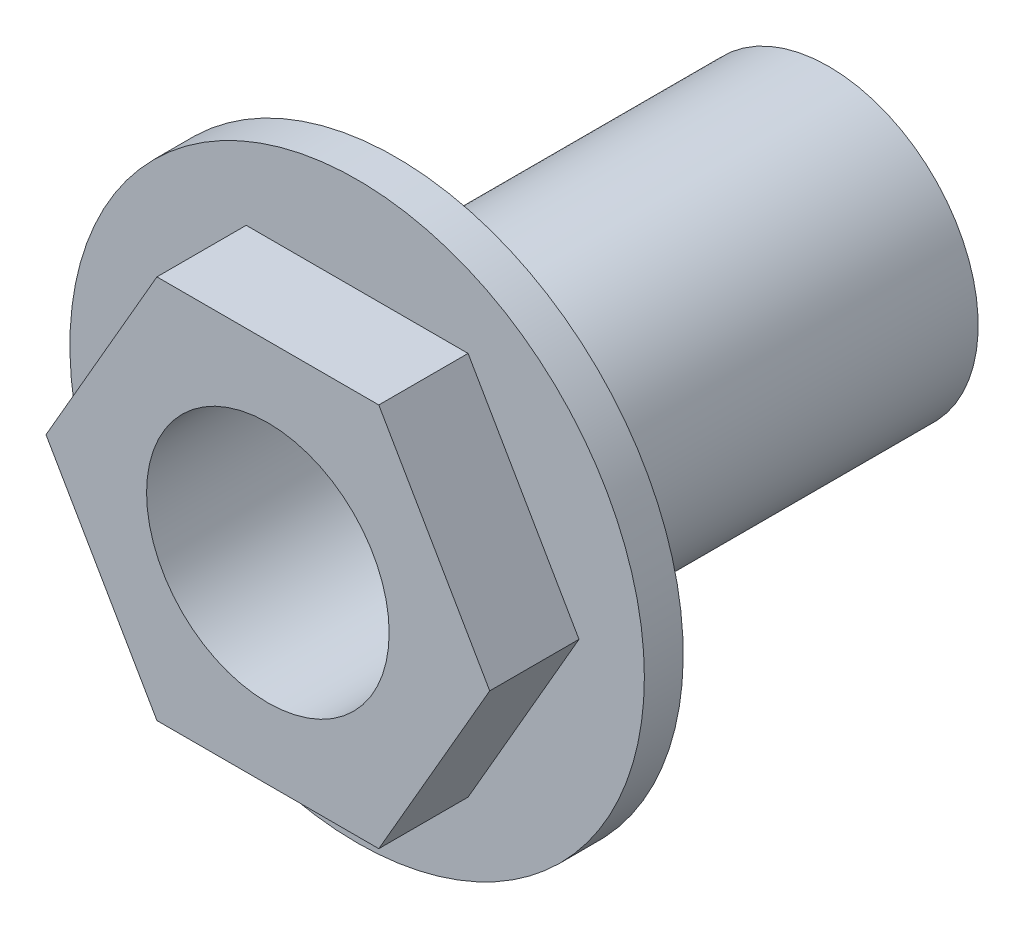
ISO-10303-21;
HEADER;
FILE_DESCRIPTION(('STEP AP214'),'2;1');
FILE_NAME('part.step','',(''),(''),'','','');
FILE_SCHEMA(('AUTOMOTIVE_DESIGN { 1 0 10303 214 1 1 1 1 }'));
ENDSEC;
DATA;
#1=APPLICATION_CONTEXT('core data for automotive mechanical design processes');
#2=APPLICATION_PROTOCOL_DEFINITION('international standard','automotive_design',2000,#1);
#3=PRODUCT_CONTEXT('',#1,'mechanical');
#4=PRODUCT('Part','Part','',(#3));
#5=PRODUCT_RELATED_PRODUCT_CATEGORY('part','',(#4));
#6=PRODUCT_DEFINITION_FORMATION('','',#4);
#7=PRODUCT_DEFINITION_CONTEXT('part definition',#1,'design');
#8=PRODUCT_DEFINITION('design','',#6,#7);
#9=PRODUCT_DEFINITION_SHAPE('','',#8);
#10=(LENGTH_UNIT() NAMED_UNIT(*) SI_UNIT(.MILLI.,.METRE.));
#11=(NAMED_UNIT(*) PLANE_ANGLE_UNIT() SI_UNIT($,.RADIAN.));
#12=(NAMED_UNIT(*) SI_UNIT($,.STERADIAN.) SOLID_ANGLE_UNIT());
#13=UNCERTAINTY_MEASURE_WITH_UNIT(LENGTH_MEASURE(1.E-05),#10,'distance_accuracy_value','');
#14=(GEOMETRIC_REPRESENTATION_CONTEXT(3) GLOBAL_UNCERTAINTY_ASSIGNED_CONTEXT((#13)) GLOBAL_UNIT_ASSIGNED_CONTEXT((#10,
#11,#12)) REPRESENTATION_CONTEXT('',''));
#15=CARTESIAN_POINT('',(0.,0.,0.));
#16=DIRECTION('',(0.,0.,1.));
#17=DIRECTION('',(1.,0.,0.));
#18=AXIS2_PLACEMENT_3D('',#15,#16,#17);
#19=CARTESIAN_POINT('',(0.,0.,12.15));
#20=DIRECTION('',(0.,0.,1.));
#21=DIRECTION('',(1.,0.,0.));
#22=AXIS2_PLACEMENT_3D('',#19,#20,#21);
#23=PLANE('',#22);
#24=CARTESIAN_POINT('',(0.,0.,12.15));
#25=DIRECTION('',(0.,0.,1.));
#26=DIRECTION('',(1.,0.,0.));
#27=AXIS2_PLACEMENT_3D('',#24,#25,#26);
#28=CIRCLE('',#27,7.4);
#29=CARTESIAN_POINT('',(7.4,0.,12.15));
#30=VERTEX_POINT('',#29);
#31=EDGE_CURVE('E9',#30,#30,#28,.T.);
#32=ORIENTED_EDGE('',*,*,#31,.T.);
#33=EDGE_LOOP('',(#32));
#34=FACE_BOUND('',#33,.T.);
#35=DIRECTION('',(0.5,0.866025403784439,0.));
#36=VECTOR('',#35,1.);
#37=CARTESIAN_POINT('',(-5.7157676649773,0.,12.15));
#38=LINE('',#37,#36);
#39=CARTESIAN_POINT('',(-5.7157676649773,0.,12.15));
#40=VERTEX_POINT('',#39);
#41=CARTESIAN_POINT('',(-2.85788383248865,4.95,12.15));
#42=VERTEX_POINT('',#41);
#43=EDGE_CURVE('E25',#40,#42,#38,.T.);
#44=ORIENTED_EDGE('',*,*,#43,.T.);
#45=DIRECTION('',(1.,0.,0.));
#46=VECTOR('',#45,1.);
#47=CARTESIAN_POINT('',(-2.85788383248865,4.95,12.15));
#48=LINE('',#47,#46);
#49=CARTESIAN_POINT('',(2.85788383248864,4.95,12.15));
#50=VERTEX_POINT('',#49);
#51=EDGE_CURVE('E34',#42,#50,#48,.T.);
#52=ORIENTED_EDGE('',*,*,#51,.T.);
#53=DIRECTION('',(0.5,-0.866025403784439,0.));
#54=VECTOR('',#53,1.);
#55=CARTESIAN_POINT('',(2.85788383248864,4.95,12.15));
#56=LINE('',#55,#54);
#57=CARTESIAN_POINT('',(5.71576766497729,0.,12.15));
#58=VERTEX_POINT('',#57);
#59=EDGE_CURVE('E75',#50,#58,#56,.T.);
#60=ORIENTED_EDGE('',*,*,#59,.T.);
#61=DIRECTION('',(-0.5,-0.866025403784439,0.));
#62=VECTOR('',#61,1.);
#63=CARTESIAN_POINT('',(5.71576766497729,0.,12.15));
#64=LINE('',#63,#62);
#65=CARTESIAN_POINT('',(2.85788383248865,-4.95,12.15));
#66=VERTEX_POINT('',#65);
#67=EDGE_CURVE('E263',#58,#66,#64,.T.);
#68=ORIENTED_EDGE('',*,*,#67,.T.);
#69=DIRECTION('',(-1.,0.,0.));
#70=VECTOR('',#69,1.);
#71=CARTESIAN_POINT('',(2.85788383248865,-4.95,12.15));
#72=LINE('',#71,#70);
#73=CARTESIAN_POINT('',(-2.85788383248865,-4.95,12.15));
#74=VERTEX_POINT('',#73);
#75=EDGE_CURVE('E260',#66,#74,#72,.T.);
#76=ORIENTED_EDGE('',*,*,#75,.T.);
#77=DIRECTION('',(-0.5,0.866025403784438,0.));
#78=VECTOR('',#77,1.);
#79=CARTESIAN_POINT('',(-2.85788383248865,-4.95,12.15));
#80=LINE('',#79,#78);
#81=EDGE_CURVE('E257',#74,#40,#80,.T.);
#82=ORIENTED_EDGE('',*,*,#81,.T.);
#83=EDGE_LOOP('',(#44,#52,#60,#68,#76,#82));
#84=FACE_BOUND('',#83,.T.);
#85=ADVANCED_FACE('F15',(#34,#84),#23,.T.);
#86=CARTESIAN_POINT('',(0.,0.,12.15));
#87=DIRECTION('',(0.,0.,-1.));
#88=DIRECTION('',(0.,-1.,0.));
#89=AXIS2_PLACEMENT_3D('',#86,#87,#88);
#90=CYLINDRICAL_SURFACE('',#89,7.4);
#91=CARTESIAN_POINT('',(0.,0.,11.15));
#92=DIRECTION('',(0.,0.,-1.));
#93=DIRECTION('',(0.,-1.,0.));
#94=AXIS2_PLACEMENT_3D('',#91,#92,#93);
#95=CIRCLE('',#94,7.4);
#96=CARTESIAN_POINT('',(0.,-7.4,11.15));
#97=VERTEX_POINT('',#96);
#98=EDGE_CURVE('E253',#97,#97,#95,.T.);
#99=ORIENTED_EDGE('',*,*,#98,.F.);
#100=EDGE_LOOP('',(#99));
#101=FACE_BOUND('',#100,.T.);
#102=ORIENTED_EDGE('',*,*,#31,.F.);
#103=EDGE_LOOP('',(#102));
#104=FACE_BOUND('',#103,.T.);
#105=ADVANCED_FACE('F17',(#101,#104),#90,.T.);
#106=CARTESIAN_POINT('',(0.,0.,11.15));
#107=DIRECTION('',(0.,0.,1.));
#108=DIRECTION('',(1.,0.,0.));
#109=AXIS2_PLACEMENT_3D('',#106,#107,#108);
#110=PLANE('',#109);
#111=CARTESIAN_POINT('',(0.,0.,11.15));
#112=DIRECTION('',(0.,0.,-1.));
#113=DIRECTION('',(0.,-1.,0.));
#114=AXIS2_PLACEMENT_3D('',#111,#112,#113);
#115=CIRCLE('',#114,3.85);
#116=CARTESIAN_POINT('',(0.,-3.85,11.15));
#117=VERTEX_POINT('',#116);
#118=EDGE_CURVE('E78',#117,#117,#115,.T.);
#119=ORIENTED_EDGE('',*,*,#118,.F.);
#120=EDGE_LOOP('',(#119));
#121=FACE_BOUND('',#120,.T.);
#122=ORIENTED_EDGE('',*,*,#98,.T.);
#123=EDGE_LOOP('',(#122));
#124=FACE_BOUND('',#123,.T.);
#125=ADVANCED_FACE('F127',(#121,#124),#110,.F.);
#126=CARTESIAN_POINT('',(-5.7157676649773,0.,14.45));
#127=DIRECTION('',(-0.866025403784439,0.5,0.));
#128=DIRECTION('',(-0.5,-0.866025403784439,0.));
#129=AXIS2_PLACEMENT_3D('',#126,#127,#128);
#130=PLANE('',#129);
#131=DIRECTION('',(0.5,0.866025403784439,0.));
#132=VECTOR('',#131,1.);
#133=CARTESIAN_POINT('',(-5.7157676649773,0.,14.45));
#134=LINE('',#133,#132);
#135=CARTESIAN_POINT('',(-5.7157676649773,0.,14.45));
#136=VERTEX_POINT('',#135);
#137=CARTESIAN_POINT('',(-2.85788383248865,4.95,14.45));
#138=VERTEX_POINT('',#137);
#139=EDGE_CURVE('E251',#136,#138,#134,.T.);
#140=ORIENTED_EDGE('',*,*,#139,.T.);
#141=DIRECTION('',(0.,0.,-1.));
#142=VECTOR('',#141,1.);
#143=CARTESIAN_POINT('',(-2.85788383248865,4.95,14.45));
#144=LINE('',#143,#142);
#145=EDGE_CURVE('E91',#138,#42,#144,.T.);
#146=ORIENTED_EDGE('',*,*,#145,.T.);
#147=ORIENTED_EDGE('',*,*,#43,.F.);
#148=DIRECTION('',(0.,0.,-1.));
#149=VECTOR('',#148,1.);
#150=CARTESIAN_POINT('',(-5.7157676649773,0.,14.45));
#151=LINE('',#150,#149);
#152=EDGE_CURVE('E243',#136,#40,#151,.T.);
#153=ORIENTED_EDGE('',*,*,#152,.F.);
#154=EDGE_LOOP('',(#140,#146,#147,#153));
#155=FACE_BOUND('',#154,.T.);
#156=ADVANCED_FACE('F133',(#155),#130,.T.);
#157=CARTESIAN_POINT('',(-2.85788383248865,-4.95,14.45));
#158=DIRECTION('',(-0.866025403784438,-0.5,0.));
#159=DIRECTION('',(0.5,-0.866025403784438,0.));
#160=AXIS2_PLACEMENT_3D('',#157,#158,#159);
#161=PLANE('',#160);
#162=DIRECTION('',(-0.5,0.866025403784438,0.));
#163=VECTOR('',#162,1.);
#164=CARTESIAN_POINT('',(-2.85788383248865,-4.95,14.45));
#165=LINE('',#164,#163);
#166=CARTESIAN_POINT('',(-2.85788383248865,-4.95,14.45));
#167=VERTEX_POINT('',#166);
#168=EDGE_CURVE('E245',#167,#136,#165,.T.);
#169=ORIENTED_EDGE('',*,*,#168,.T.);
#170=ORIENTED_EDGE('',*,*,#152,.T.);
#171=ORIENTED_EDGE('',*,*,#81,.F.);
#172=DIRECTION('',(0.,0.,-1.));
#173=VECTOR('',#172,1.);
#174=CARTESIAN_POINT('',(-2.85788383248865,-4.95,14.45));
#175=LINE('',#174,#173);
#176=EDGE_CURVE('E235',#167,#74,#175,.T.);
#177=ORIENTED_EDGE('',*,*,#176,.F.);
#178=EDGE_LOOP('',(#169,#170,#171,#177));
#179=FACE_BOUND('',#178,.T.);
#180=ADVANCED_FACE('F137',(#179),#161,.T.);
#181=CARTESIAN_POINT('',(2.85788383248865,-4.95,14.45));
#182=DIRECTION('',(0.,-1.,0.));
#183=DIRECTION('',(1.,0.,0.));
#184=AXIS2_PLACEMENT_3D('',#181,#182,#183);
#185=PLANE('',#184);
#186=DIRECTION('',(-1.,0.,0.));
#187=VECTOR('',#186,1.);
#188=CARTESIAN_POINT('',(2.85788383248865,-4.95,14.45));
#189=LINE('',#188,#187);
#190=CARTESIAN_POINT('',(2.85788383248865,-4.95,14.45));
#191=VERTEX_POINT('',#190);
#192=EDGE_CURVE('E238',#191,#167,#189,.T.);
#193=ORIENTED_EDGE('',*,*,#192,.T.);
#194=ORIENTED_EDGE('',*,*,#176,.T.);
#195=ORIENTED_EDGE('',*,*,#75,.F.);
#196=DIRECTION('',(0.,0.,-1.));
#197=VECTOR('',#196,1.);
#198=CARTESIAN_POINT('',(2.85788383248865,-4.95,14.45));
#199=LINE('',#198,#197);
#200=EDGE_CURVE('E87',#191,#66,#199,.T.);
#201=ORIENTED_EDGE('',*,*,#200,.F.);
#202=EDGE_LOOP('',(#193,#194,#195,#201));
#203=FACE_BOUND('',#202,.T.);
#204=ADVANCED_FACE('F141',(#203),#185,.T.);
#205=CARTESIAN_POINT('',(5.71576766497729,0.,14.45));
#206=DIRECTION('',(0.866025403784439,-0.5,0.));
#207=DIRECTION('',(0.5,0.866025403784439,0.));
#208=AXIS2_PLACEMENT_3D('',#205,#206,#207);
#209=PLANE('',#208);
#210=DIRECTION('',(-0.5,-0.866025403784439,0.));
#211=VECTOR('',#210,1.);
#212=CARTESIAN_POINT('',(5.71576766497729,0.,14.45));
#213=LINE('',#212,#211);
#214=CARTESIAN_POINT('',(5.71576766497729,0.,14.45));
#215=VERTEX_POINT('',#214);
#216=EDGE_CURVE('E86',#215,#191,#213,.T.);
#217=ORIENTED_EDGE('',*,*,#216,.T.);
#218=ORIENTED_EDGE('',*,*,#200,.T.);
#219=ORIENTED_EDGE('',*,*,#67,.F.);
#220=DIRECTION('',(0.,0.,-1.));
#221=VECTOR('',#220,1.);
#222=CARTESIAN_POINT('',(5.71576766497729,0.,14.45));
#223=LINE('',#222,#221);
#224=EDGE_CURVE('E65',#215,#58,#223,.T.);
#225=ORIENTED_EDGE('',*,*,#224,.F.);
#226=EDGE_LOOP('',(#217,#218,#219,#225));
#227=FACE_BOUND('',#226,.T.);
#228=ADVANCED_FACE('F145',(#227),#209,.T.);
#229=CARTESIAN_POINT('',(2.85788383248864,4.95,14.45));
#230=DIRECTION('',(0.866025403784439,0.5,0.));
#231=DIRECTION('',(-0.5,0.866025403784439,0.));
#232=AXIS2_PLACEMENT_3D('',#229,#230,#231);
#233=PLANE('',#232);
#234=DIRECTION('',(0.5,-0.866025403784439,0.));
#235=VECTOR('',#234,1.);
#236=CARTESIAN_POINT('',(2.85788383248864,4.95,14.45));
#237=LINE('',#236,#235);
#238=CARTESIAN_POINT('',(2.85788383248864,4.95,14.45));
#239=VERTEX_POINT('',#238);
#240=EDGE_CURVE('E73',#239,#215,#237,.T.);
#241=ORIENTED_EDGE('',*,*,#240,.T.);
#242=ORIENTED_EDGE('',*,*,#224,.T.);
#243=ORIENTED_EDGE('',*,*,#59,.F.);
#244=DIRECTION('',(0.,0.,-1.));
#245=VECTOR('',#244,1.);
#246=CARTESIAN_POINT('',(2.85788383248864,4.95,14.45));
#247=LINE('',#246,#245);
#248=EDGE_CURVE('E70',#239,#50,#247,.T.);
#249=ORIENTED_EDGE('',*,*,#248,.F.);
#250=EDGE_LOOP('',(#241,#242,#243,#249));
#251=FACE_BOUND('',#250,.T.);
#252=ADVANCED_FACE('F72',(#251),#233,.T.);
#253=CARTESIAN_POINT('',(-2.85788383248865,4.95,14.45));
#254=DIRECTION('',(0.,1.,0.));
#255=DIRECTION('',(-1.,0.,0.));
#256=AXIS2_PLACEMENT_3D('',#253,#254,#255);
#257=PLANE('',#256);
#258=DIRECTION('',(1.,0.,0.));
#259=VECTOR('',#258,1.);
#260=CARTESIAN_POINT('',(-2.85788383248865,4.95,14.45));
#261=LINE('',#260,#259);
#262=EDGE_CURVE('E77',#138,#239,#261,.T.);
#263=ORIENTED_EDGE('',*,*,#262,.T.);
#264=ORIENTED_EDGE('',*,*,#248,.T.);
#265=ORIENTED_EDGE('',*,*,#51,.F.);
#266=ORIENTED_EDGE('',*,*,#145,.F.);
#267=EDGE_LOOP('',(#263,#264,#265,#266));
#268=FACE_BOUND('',#267,.T.);
#269=ADVANCED_FACE('F89',(#268),#257,.T.);
#270=CARTESIAN_POINT('',(0.,0.,0.));
#271=DIRECTION('',(0.,0.,1.));
#272=DIRECTION('',(1.,0.,0.));
#273=AXIS2_PLACEMENT_3D('',#270,#271,#272);
#274=CYLINDRICAL_SURFACE('',#273,3.125);
#275=CARTESIAN_POINT('',(0.,0.,14.45));
#276=DIRECTION('',(0.,0.,-1.));
#277=DIRECTION('',(0.,-1.,0.));
#278=AXIS2_PLACEMENT_3D('',#275,#276,#277);
#279=CIRCLE('',#278,3.125);
#280=CARTESIAN_POINT('',(0.,-3.125,14.45));
#281=VERTEX_POINT('',#280);
#282=EDGE_CURVE('E96',#281,#281,#279,.T.);
#283=ORIENTED_EDGE('',*,*,#282,.F.);
#284=EDGE_LOOP('',(#283));
#285=FACE_BOUND('',#284,.T.);
#286=CARTESIAN_POINT('',(0.,0.,0.));
#287=DIRECTION('',(0.,0.,1.));
#288=DIRECTION('',(1.,0.,0.));
#289=AXIS2_PLACEMENT_3D('',#286,#287,#288);
#290=CIRCLE('',#289,3.125);
#291=CARTESIAN_POINT('',(3.125,0.,0.));
#292=VERTEX_POINT('',#291);
#293=EDGE_CURVE('E98',#292,#292,#290,.T.);
#294=ORIENTED_EDGE('',*,*,#293,.F.);
#295=EDGE_LOOP('',(#294));
#296=FACE_BOUND('',#295,.T.);
#297=ADVANCED_FACE('F109',(#285,#296),#274,.F.);
#298=CARTESIAN_POINT('',(0.,0.,0.));
#299=DIRECTION('',(0.,0.,1.));
#300=DIRECTION('',(1.,0.,0.));
#301=AXIS2_PLACEMENT_3D('',#298,#299,#300);
#302=CYLINDRICAL_SURFACE('',#301,3.85);
#303=ORIENTED_EDGE('',*,*,#118,.T.);
#304=EDGE_LOOP('',(#303));
#305=FACE_BOUND('',#304,.T.);
#306=CARTESIAN_POINT('',(0.,0.,0.));
#307=DIRECTION('',(0.,0.,-1.));
#308=DIRECTION('',(0.,-1.,0.));
#309=AXIS2_PLACEMENT_3D('',#306,#307,#308);
#310=CIRCLE('',#309,3.85);
#311=CARTESIAN_POINT('',(0.,-3.85,0.));
#312=VERTEX_POINT('',#311);
#313=EDGE_CURVE('E19',#312,#312,#310,.T.);
#314=ORIENTED_EDGE('',*,*,#313,.F.);
#315=EDGE_LOOP('',(#314));
#316=FACE_BOUND('',#315,.T.);
#317=ADVANCED_FACE('F107',(#305,#316),#302,.T.);
#318=CARTESIAN_POINT('',(0.,0.,14.45));
#319=DIRECTION('',(0.,0.,1.));
#320=DIRECTION('',(1.,0.,0.));
#321=AXIS2_PLACEMENT_3D('',#318,#319,#320);
#322=PLANE('',#321);
#323=ORIENTED_EDGE('',*,*,#262,.F.);
#324=ORIENTED_EDGE('',*,*,#139,.F.);
#325=ORIENTED_EDGE('',*,*,#168,.F.);
#326=ORIENTED_EDGE('',*,*,#192,.F.);
#327=ORIENTED_EDGE('',*,*,#216,.F.);
#328=ORIENTED_EDGE('',*,*,#240,.F.);
#329=EDGE_LOOP('',(#323,#324,#325,#326,#327,#328));
#330=FACE_BOUND('',#329,.T.);
#331=ORIENTED_EDGE('',*,*,#282,.T.);
#332=EDGE_LOOP('',(#331));
#333=FACE_BOUND('',#332,.T.);
#334=ADVANCED_FACE('F82',(#330,#333),#322,.T.);
#335=CARTESIAN_POINT('',(0.,0.,0.));
#336=DIRECTION('',(0.,0.,1.));
#337=DIRECTION('',(1.,0.,0.));
#338=AXIS2_PLACEMENT_3D('',#335,#336,#337);
#339=PLANE('',#338);
#340=ORIENTED_EDGE('',*,*,#293,.T.);
#341=EDGE_LOOP('',(#340));
#342=FACE_BOUND('',#341,.T.);
#343=ORIENTED_EDGE('',*,*,#313,.T.);
#344=EDGE_LOOP('',(#343));
#345=FACE_BOUND('',#344,.T.);
#346=ADVANCED_FACE('F105',(#342,#345),#339,.F.);
#347=CLOSED_SHELL('',(#85,#105,#125,#156,#180,#204,#228,#252,#269,#297,#317,#334,#346));
#348=MANIFOLD_SOLID_BREP('B1',#347);
#349=ADVANCED_BREP_SHAPE_REPRESENTATION('',(#18,#348),#14);
#350=SHAPE_DEFINITION_REPRESENTATION(#9,#349);
ENDSEC;
END-ISO-10303-21;
